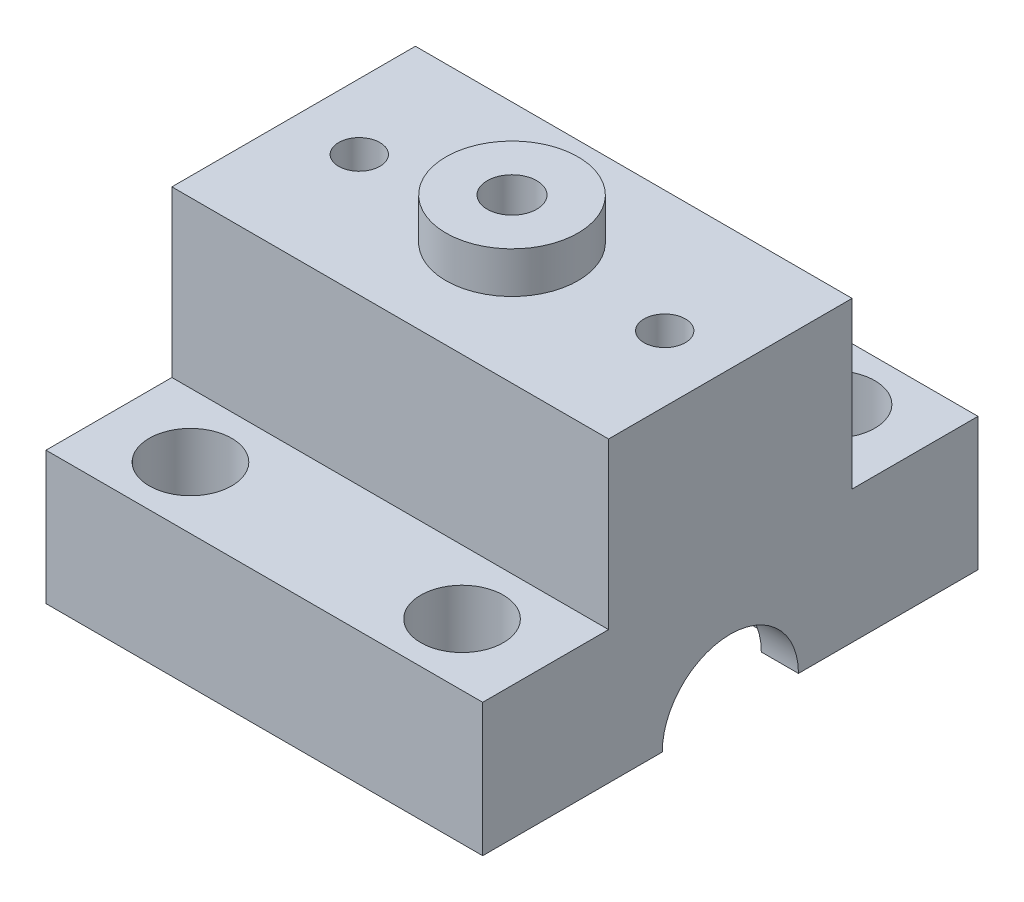
ISO-10303-21;
HEADER;
FILE_DESCRIPTION(('STEP AP214'),'2;1');
FILE_NAME('part.step','',(''),(''),'','','');
FILE_SCHEMA(('AUTOMOTIVE_DESIGN { 1 0 10303 214 1 1 1 1 }'));
ENDSEC;
DATA;
#1=APPLICATION_CONTEXT('core data for automotive mechanical design processes');
#2=APPLICATION_PROTOCOL_DEFINITION('international standard','automotive_design',2000,#1);
#3=PRODUCT_CONTEXT('',#1,'mechanical');
#4=PRODUCT('Part','Part','',(#3));
#5=PRODUCT_RELATED_PRODUCT_CATEGORY('part','',(#4));
#6=PRODUCT_DEFINITION_FORMATION('','',#4);
#7=PRODUCT_DEFINITION_CONTEXT('part definition',#1,'design');
#8=PRODUCT_DEFINITION('design','',#6,#7);
#9=PRODUCT_DEFINITION_SHAPE('','',#8);
#10=(LENGTH_UNIT() NAMED_UNIT(*) SI_UNIT(.MILLI.,.METRE.));
#11=(NAMED_UNIT(*) PLANE_ANGLE_UNIT() SI_UNIT($,.RADIAN.));
#12=(NAMED_UNIT(*) SI_UNIT($,.STERADIAN.) SOLID_ANGLE_UNIT());
#13=UNCERTAINTY_MEASURE_WITH_UNIT(LENGTH_MEASURE(1.E-05),#10,'distance_accuracy_value','');
#14=(GEOMETRIC_REPRESENTATION_CONTEXT(3) GLOBAL_UNCERTAINTY_ASSIGNED_CONTEXT((#13)) GLOBAL_UNIT_ASSIGNED_CONTEXT((#10,
#11,#12)) REPRESENTATION_CONTEXT('',''));
#15=CARTESIAN_POINT('',(0.,0.,0.));
#16=DIRECTION('',(0.,0.,1.));
#17=DIRECTION('',(1.,0.,0.));
#18=AXIS2_PLACEMENT_3D('',#15,#16,#17);
#19=CARTESIAN_POINT('',(0.,5.,0.));
#20=DIRECTION('',(0.,1.,0.));
#21=DIRECTION('',(0.,0.,1.));
#22=AXIS2_PLACEMENT_3D('',#19,#20,#21);
#23=PLANE('',#22);
#24=CARTESIAN_POINT('',(-16.45,5.,22.5));
#25=DIRECTION('',(0.,1.,0.));
#26=DIRECTION('',(0.,0.,1.));
#27=AXIS2_PLACEMENT_3D('',#24,#25,#26);
#28=CIRCLE('',#27,5.);
#29=CARTESIAN_POINT('',(-16.45,5.,27.5));
#30=VERTEX_POINT('',#29);
#31=EDGE_CURVE('E298',#30,#30,#28,.T.);
#32=ORIENTED_EDGE('',*,*,#31,.F.);
#33=EDGE_LOOP('',(#32));
#34=FACE_BOUND('',#33,.T.);
#35=CARTESIAN_POINT('',(16.45,5.,22.5));
#36=DIRECTION('',(0.,1.,0.));
#37=DIRECTION('',(0.,0.,1.));
#38=AXIS2_PLACEMENT_3D('',#35,#36,#37);
#39=CIRCLE('',#38,5.);
#40=CARTESIAN_POINT('',(16.45,5.,27.5));
#41=VERTEX_POINT('',#40);
#42=EDGE_CURVE('E299',#41,#41,#39,.T.);
#43=ORIENTED_EDGE('',*,*,#42,.F.);
#44=EDGE_LOOP('',(#43));
#45=FACE_BOUND('',#44,.T.);
#46=DIRECTION('',(0.,0.,-1.));
#47=VECTOR('',#46,1.);
#48=CARTESIAN_POINT('',(26.45,5.,-15.));
#49=LINE('',#48,#47);
#50=CARTESIAN_POINT('',(26.45,5.,30.));
#51=VERTEX_POINT('',#50);
#52=CARTESIAN_POINT('',(26.45,5.,14.75));
#53=VERTEX_POINT('',#52);
#54=EDGE_CURVE('E460',#51,#53,#49,.T.);
#55=ORIENTED_EDGE('',*,*,#54,.T.);
#56=DIRECTION('',(1.,0.,0.));
#57=VECTOR('',#56,1.);
#58=CARTESIAN_POINT('',(0.,5.,14.75));
#59=LINE('',#58,#57);
#60=CARTESIAN_POINT('',(-26.45,5.,14.75));
#61=VERTEX_POINT('',#60);
#62=EDGE_CURVE('E92',#61,#53,#59,.T.);
#63=ORIENTED_EDGE('',*,*,#62,.F.);
#64=DIRECTION('',(0.,0.,1.));
#65=VECTOR('',#64,1.);
#66=CARTESIAN_POINT('',(-26.45,5.,-15.));
#67=LINE('',#66,#65);
#68=CARTESIAN_POINT('',(-26.45,5.,30.));
#69=VERTEX_POINT('',#68);
#70=EDGE_CURVE('E463',#61,#69,#67,.T.);
#71=ORIENTED_EDGE('',*,*,#70,.T.);
#72=DIRECTION('',(1.,0.,0.));
#73=VECTOR('',#72,1.);
#74=CARTESIAN_POINT('',(26.45,5.,30.));
#75=LINE('',#74,#73);
#76=EDGE_CURVE('E322',#69,#51,#75,.T.);
#77=ORIENTED_EDGE('',*,*,#76,.T.);
#78=EDGE_LOOP('',(#55,#63,#71,#77));
#79=FACE_BOUND('',#78,.T.);
#80=ADVANCED_FACE('F68',(#34,#45,#79),#23,.T.);
#81=CARTESIAN_POINT('',(0.,25.,0.));
#82=DIRECTION('',(0.,1.,0.));
#83=DIRECTION('',(0.,0.,1.));
#84=AXIS2_PLACEMENT_3D('',#81,#82,#83);
#85=PLANE('',#84);
#86=CARTESIAN_POINT('',(0.,25.,0.));
#87=DIRECTION('',(0.,1.,0.));
#88=DIRECTION('',(0.,0.,1.));
#89=AXIS2_PLACEMENT_3D('',#86,#87,#88);
#90=CIRCLE('',#89,1.65);
#91=CARTESIAN_POINT('',(0.,25.,1.65));
#92=VERTEX_POINT('',#91);
#93=EDGE_CURVE('E346',#92,#92,#90,.T.);
#94=ORIENTED_EDGE('',*,*,#93,.F.);
#95=EDGE_LOOP('',(#94));
#96=FACE_BOUND('',#95,.T.);
#97=CARTESIAN_POINT('',(0.,25.,0.));
#98=DIRECTION('',(0.,1.,0.));
#99=DIRECTION('',(0.,0.,1.));
#100=AXIS2_PLACEMENT_3D('',#97,#98,#99);
#101=CIRCLE('',#100,3.);
#102=CARTESIAN_POINT('',(0.,25.,3.));
#103=VERTEX_POINT('',#102);
#104=EDGE_CURVE('E12',#103,#103,#101,.F.);
#105=ORIENTED_EDGE('',*,*,#104,.F.);
#106=EDGE_LOOP('',(#105));
#107=FACE_BOUND('',#106,.T.);
#108=ADVANCED_FACE('F551',(#96,#107),#85,.T.);
#109=DIRECTION('',(1.,0.,0.));
#110=VECTOR('',#109,1.);
#111=CARTESIAN_POINT('',(0.,5.,-14.75));
#112=LINE('',#111,#110);
#113=CARTESIAN_POINT('',(-26.45,5.,-14.75));
#114=VERTEX_POINT('',#113);
#115=CARTESIAN_POINT('',(26.45,5.,-14.75));
#116=VERTEX_POINT('',#115);
#117=EDGE_CURVE('E84',#114,#116,#112,.T.);
#118=ORIENTED_EDGE('',*,*,#117,.T.);
#119=CARTESIAN_POINT('',(26.45,5.,-30.));
#120=VERTEX_POINT('',#119);
#121=EDGE_CURVE('E459',#116,#120,#49,.T.);
#122=ORIENTED_EDGE('',*,*,#121,.T.);
#123=DIRECTION('',(-1.,0.,0.));
#124=VECTOR('',#123,1.);
#125=CARTESIAN_POINT('',(26.45,5.,-30.));
#126=LINE('',#125,#124);
#127=CARTESIAN_POINT('',(-26.45,5.,-30.));
#128=VERTEX_POINT('',#127);
#129=EDGE_CURVE('E329',#120,#128,#126,.T.);
#130=ORIENTED_EDGE('',*,*,#129,.T.);
#131=EDGE_CURVE('E464',#128,#114,#67,.T.);
#132=ORIENTED_EDGE('',*,*,#131,.T.);
#133=EDGE_LOOP('',(#118,#122,#130,#132));
#134=FACE_BOUND('',#133,.T.);
#135=CARTESIAN_POINT('',(-16.45,5.,-22.5));
#136=DIRECTION('',(0.,1.,0.));
#137=DIRECTION('',(0.,0.,1.));
#138=AXIS2_PLACEMENT_3D('',#135,#136,#137);
#139=CIRCLE('',#138,5.);
#140=CARTESIAN_POINT('',(-16.45,5.,-17.5));
#141=VERTEX_POINT('',#140);
#142=EDGE_CURVE('E290',#141,#141,#139,.T.);
#143=ORIENTED_EDGE('',*,*,#142,.F.);
#144=EDGE_LOOP('',(#143));
#145=FACE_BOUND('',#144,.T.);
#146=CARTESIAN_POINT('',(16.45,5.,-22.5));
#147=DIRECTION('',(0.,1.,0.));
#148=DIRECTION('',(0.,0.,1.));
#149=AXIS2_PLACEMENT_3D('',#146,#147,#148);
#150=CIRCLE('',#149,5.);
#151=CARTESIAN_POINT('',(16.45,5.,-17.5));
#152=VERTEX_POINT('',#151);
#153=EDGE_CURVE('E307',#152,#152,#150,.T.);
#154=ORIENTED_EDGE('',*,*,#153,.F.);
#155=EDGE_LOOP('',(#154));
#156=FACE_BOUND('',#155,.T.);
#157=ADVANCED_FACE('F557',(#134,#145,#156),#23,.T.);
#158=CARTESIAN_POINT('',(0.,-11.1,0.));
#159=DIRECTION('',(0.,-1.,0.));
#160=DIRECTION('',(0.,0.,-1.));
#161=AXIS2_PLACEMENT_3D('',#158,#159,#160);
#162=PLANE('',#161);
#163=CARTESIAN_POINT('',(16.45,-11.1,-22.5));
#164=DIRECTION('',(0.,1.,0.));
#165=DIRECTION('',(0.,0.,1.));
#166=AXIS2_PLACEMENT_3D('',#163,#164,#165);
#167=CIRCLE('',#166,2.2);
#168=CARTESIAN_POINT('',(16.45,-11.1,-20.3));
#169=VERTEX_POINT('',#168);
#170=EDGE_CURVE('E271',#169,#169,#167,.T.);
#171=ORIENTED_EDGE('',*,*,#170,.T.);
#172=EDGE_LOOP('',(#171));
#173=FACE_BOUND('',#172,.T.);
#174=CARTESIAN_POINT('',(-16.45,-11.1,-22.5));
#175=DIRECTION('',(0.,1.,0.));
#176=DIRECTION('',(0.,0.,1.));
#177=AXIS2_PLACEMENT_3D('',#174,#175,#176);
#178=CIRCLE('',#177,2.2);
#179=CARTESIAN_POINT('',(-16.45,-11.1,-20.3));
#180=VERTEX_POINT('',#179);
#181=EDGE_CURVE('E262',#180,#180,#178,.T.);
#182=ORIENTED_EDGE('',*,*,#181,.T.);
#183=EDGE_LOOP('',(#182));
#184=FACE_BOUND('',#183,.T.);
#185=DIRECTION('',(1.,0.,0.));
#186=VECTOR('',#185,1.);
#187=CARTESIAN_POINT('',(-26.45,-11.1,-8.25));
#188=LINE('',#187,#186);
#189=CARTESIAN_POINT('',(-26.45,-11.1,-8.25));
#190=VERTEX_POINT('',#189);
#191=CARTESIAN_POINT('',(-21.95,-11.1,-8.25));
#192=VERTEX_POINT('',#191);
#193=EDGE_CURVE('E396',#190,#192,#188,.T.);
#194=ORIENTED_EDGE('',*,*,#193,.F.);
#195=DIRECTION('',(0.,0.,-1.));
#196=VECTOR('',#195,1.);
#197=CARTESIAN_POINT('',(-26.45,-11.1,15.));
#198=LINE('',#197,#196);
#199=CARTESIAN_POINT('',(-26.45,-11.1,-30.));
#200=VERTEX_POINT('',#199);
#201=EDGE_CURVE('E445',#190,#200,#198,.T.);
#202=ORIENTED_EDGE('',*,*,#201,.T.);
#203=DIRECTION('',(-1.,0.,0.));
#204=VECTOR('',#203,1.);
#205=CARTESIAN_POINT('',(26.45,-11.1,-30.));
#206=LINE('',#205,#204);
#207=CARTESIAN_POINT('',(26.45,-11.1,-30.));
#208=VERTEX_POINT('',#207);
#209=EDGE_CURVE('E373',#208,#200,#206,.T.);
#210=ORIENTED_EDGE('',*,*,#209,.F.);
#211=DIRECTION('',(0.,0.,1.));
#212=VECTOR('',#211,1.);
#213=CARTESIAN_POINT('',(26.45,-11.1,15.));
#214=LINE('',#213,#212);
#215=CARTESIAN_POINT('',(26.45,-11.1,-8.25));
#216=VERTEX_POINT('',#215);
#217=EDGE_CURVE('E451',#208,#216,#214,.T.);
#218=ORIENTED_EDGE('',*,*,#217,.T.);
#219=CARTESIAN_POINT('',(21.95,-11.1,-8.25));
#220=VERTEX_POINT('',#219);
#221=EDGE_CURVE('E391',#220,#216,#188,.T.);
#222=ORIENTED_EDGE('',*,*,#221,.F.);
#223=DIRECTION('',(0.,0.,1.));
#224=VECTOR('',#223,1.);
#225=CARTESIAN_POINT('',(21.95,-11.1,10.5));
#226=LINE('',#225,#224);
#227=CARTESIAN_POINT('',(21.95,-11.1,-10.5));
#228=VERTEX_POINT('',#227);
#229=EDGE_CURVE('E413',#228,#220,#226,.T.);
#230=ORIENTED_EDGE('',*,*,#229,.F.);
#231=DIRECTION('',(1.,0.,0.));
#232=VECTOR('',#231,1.);
#233=CARTESIAN_POINT('',(-21.95,-11.1,-10.5));
#234=LINE('',#233,#232);
#235=CARTESIAN_POINT('',(-21.95,-11.1,-10.5));
#236=VERTEX_POINT('',#235);
#237=EDGE_CURVE('E408',#236,#228,#234,.T.);
#238=ORIENTED_EDGE('',*,*,#237,.F.);
#239=DIRECTION('',(0.,0.,-1.));
#240=VECTOR('',#239,1.);
#241=CARTESIAN_POINT('',(-21.95,-11.1,10.5));
#242=LINE('',#241,#240);
#243=EDGE_CURVE('E402',#192,#236,#242,.T.);
#244=ORIENTED_EDGE('',*,*,#243,.F.);
#245=EDGE_LOOP('',(#194,#202,#210,#218,#222,#230,#238,#244));
#246=FACE_BOUND('',#245,.T.);
#247=ADVANCED_FACE('F478',(#173,#184,#246),#162,.T.);
#248=CARTESIAN_POINT('',(0.,0.,0.));
#249=DIRECTION('',(0.,1.,0.));
#250=DIRECTION('',(0.,0.,1.));
#251=AXIS2_PLACEMENT_3D('',#248,#249,#250);
#252=PLANE('',#251);
#253=DIRECTION('',(0.,0.,1.));
#254=VECTOR('',#253,1.);
#255=CARTESIAN_POINT('',(21.95,0.,10.5));
#256=LINE('',#255,#254);
#257=CARTESIAN_POINT('',(21.95,0.,-10.5));
#258=VERTEX_POINT('',#257);
#259=CARTESIAN_POINT('',(21.95,0.,10.5));
#260=VERTEX_POINT('',#259);
#261=EDGE_CURVE('E403',#258,#260,#256,.T.);
#262=ORIENTED_EDGE('',*,*,#261,.T.);
#263=DIRECTION('',(-1.,0.,0.));
#264=VECTOR('',#263,1.);
#265=CARTESIAN_POINT('',(-21.95,0.,10.5));
#266=LINE('',#265,#264);
#267=CARTESIAN_POINT('',(-21.95,0.,10.5));
#268=VERTEX_POINT('',#267);
#269=EDGE_CURVE('E418',#260,#268,#266,.T.);
#270=ORIENTED_EDGE('',*,*,#269,.T.);
#271=DIRECTION('',(0.,0.,-1.));
#272=VECTOR('',#271,1.);
#273=CARTESIAN_POINT('',(-21.95,0.,10.5));
#274=LINE('',#273,#272);
#275=CARTESIAN_POINT('',(-21.95,0.,-10.5));
#276=VERTEX_POINT('',#275);
#277=EDGE_CURVE('E422',#268,#276,#274,.T.);
#278=ORIENTED_EDGE('',*,*,#277,.T.);
#279=DIRECTION('',(1.,0.,0.));
#280=VECTOR('',#279,1.);
#281=CARTESIAN_POINT('',(-21.95,0.,-10.5));
#282=LINE('',#281,#280);
#283=EDGE_CURVE('E426',#276,#258,#282,.T.);
#284=ORIENTED_EDGE('',*,*,#283,.T.);
#285=EDGE_LOOP('',(#262,#270,#278,#284));
#286=FACE_BOUND('',#285,.T.);
#287=CARTESIAN_POINT('',(0.,0.,0.));
#288=DIRECTION('',(0.,1.,0.));
#289=DIRECTION('',(0.,0.,1.));
#290=AXIS2_PLACEMENT_3D('',#287,#288,#289);
#291=CIRCLE('',#290,10.25);
#292=CARTESIAN_POINT('',(0.,0.,10.25));
#293=VERTEX_POINT('',#292);
#294=EDGE_CURVE('E455',#293,#293,#291,.T.);
#295=ORIENTED_EDGE('',*,*,#294,.T.);
#296=EDGE_LOOP('',(#295));
#297=FACE_BOUND('',#296,.T.);
#298=ADVANCED_FACE('F526',(#286,#297),#252,.F.);
#299=CARTESIAN_POINT('',(26.45,5.,-15.));
#300=DIRECTION('',(-1.,0.,0.));
#301=DIRECTION('',(0.,0.,1.));
#302=AXIS2_PLACEMENT_3D('',#299,#300,#301);
#303=PLANE('',#302);
#304=CARTESIAN_POINT('',(26.45,-11.1,8.25));
#305=VERTEX_POINT('',#304);
#306=CARTESIAN_POINT('',(26.45,-11.1,30.));
#307=VERTEX_POINT('',#306);
#308=EDGE_CURVE('E450',#305,#307,#214,.T.);
#309=ORIENTED_EDGE('',*,*,#308,.F.);
#310=CARTESIAN_POINT('',(26.45,-11.1,0.));
#311=DIRECTION('',(1.,0.,0.));
#312=DIRECTION('',(0.,0.,-1.));
#313=AXIS2_PLACEMENT_3D('',#310,#311,#312);
#314=CIRCLE('',#313,8.25);
#315=EDGE_CURVE('E381',#216,#305,#314,.T.);
#316=ORIENTED_EDGE('',*,*,#315,.F.);
#317=ORIENTED_EDGE('',*,*,#217,.F.);
#318=DIRECTION('',(0.,-1.,0.));
#319=VECTOR('',#318,1.);
#320=CARTESIAN_POINT('',(26.45,-11.1,-30.));
#321=LINE('',#320,#319);
#322=EDGE_CURVE('E369',#120,#208,#321,.T.);
#323=ORIENTED_EDGE('',*,*,#322,.F.);
#324=ORIENTED_EDGE('',*,*,#121,.F.);
#325=DIRECTION('',(0.,-1.,0.));
#326=VECTOR('',#325,1.);
#327=CARTESIAN_POINT('',(26.45,64.6213641865093,-14.75));
#328=LINE('',#327,#326);
#329=CARTESIAN_POINT('',(26.45,25.,-14.75));
#330=VERTEX_POINT('',#329);
#331=EDGE_CURVE('E218',#330,#116,#328,.T.);
#332=ORIENTED_EDGE('',*,*,#331,.F.);
#333=DIRECTION('',(0.,0.,-1.));
#334=VECTOR('',#333,1.);
#335=CARTESIAN_POINT('',(26.45,25.,0.));
#336=LINE('',#335,#334);
#337=CARTESIAN_POINT('',(26.45,25.,14.75));
#338=VERTEX_POINT('',#337);
#339=EDGE_CURVE('E237',#338,#330,#336,.T.);
#340=ORIENTED_EDGE('',*,*,#339,.F.);
#341=DIRECTION('',(0.,-1.,0.));
#342=VECTOR('',#341,1.);
#343=CARTESIAN_POINT('',(26.45,64.6213641865093,14.75));
#344=LINE('',#343,#342);
#345=EDGE_CURVE('E233',#338,#53,#344,.T.);
#346=ORIENTED_EDGE('',*,*,#345,.T.);
#347=ORIENTED_EDGE('',*,*,#54,.F.);
#348=DIRECTION('',(0.,1.,0.));
#349=VECTOR('',#348,1.);
#350=CARTESIAN_POINT('',(26.45,-11.1,30.));
#351=LINE('',#350,#349);
#352=EDGE_CURVE('E365',#307,#51,#351,.T.);
#353=ORIENTED_EDGE('',*,*,#352,.F.);
#354=EDGE_LOOP('',(#309,#316,#317,#323,#324,#332,#340,#346,#347,#353));
#355=FACE_BOUND('',#354,.T.);
#356=ADVANCED_FACE('F70',(#355),#303,.F.);
#357=CARTESIAN_POINT('',(-26.45,5.,-15.));
#358=DIRECTION('',(1.,0.,0.));
#359=DIRECTION('',(0.,0.,-1.));
#360=AXIS2_PLACEMENT_3D('',#357,#358,#359);
#361=PLANE('',#360);
#362=ORIENTED_EDGE('',*,*,#201,.F.);
#363=CARTESIAN_POINT('',(-26.45,-11.1,0.));
#364=DIRECTION('',(1.,0.,0.));
#365=DIRECTION('',(0.,0.,-1.));
#366=AXIS2_PLACEMENT_3D('',#363,#364,#365);
#367=CIRCLE('',#366,8.25);
#368=CARTESIAN_POINT('',(-26.45,-11.1,8.25));
#369=VERTEX_POINT('',#368);
#370=EDGE_CURVE('E382',#190,#369,#367,.T.);
#371=ORIENTED_EDGE('',*,*,#370,.T.);
#372=CARTESIAN_POINT('',(-26.45,-11.1,30.));
#373=VERTEX_POINT('',#372);
#374=EDGE_CURVE('E446',#373,#369,#198,.T.);
#375=ORIENTED_EDGE('',*,*,#374,.F.);
#376=DIRECTION('',(0.,-1.,0.));
#377=VECTOR('',#376,1.);
#378=CARTESIAN_POINT('',(-26.45,-11.1,30.));
#379=LINE('',#378,#377);
#380=EDGE_CURVE('E357',#69,#373,#379,.T.);
#381=ORIENTED_EDGE('',*,*,#380,.F.);
#382=ORIENTED_EDGE('',*,*,#70,.F.);
#383=DIRECTION('',(0.,-1.,0.));
#384=VECTOR('',#383,1.);
#385=CARTESIAN_POINT('',(-26.45,64.6213641865093,14.75));
#386=LINE('',#385,#384);
#387=CARTESIAN_POINT('',(-26.45,25.,14.75));
#388=VERTEX_POINT('',#387);
#389=EDGE_CURVE('E244',#388,#61,#386,.T.);
#390=ORIENTED_EDGE('',*,*,#389,.F.);
#391=DIRECTION('',(0.,0.,1.));
#392=VECTOR('',#391,1.);
#393=CARTESIAN_POINT('',(-26.45,25.,0.));
#394=LINE('',#393,#392);
#395=CARTESIAN_POINT('',(-26.45,25.,-14.75));
#396=VERTEX_POINT('',#395);
#397=EDGE_CURVE('E247',#396,#388,#394,.T.);
#398=ORIENTED_EDGE('',*,*,#397,.F.);
#399=DIRECTION('',(0.,-1.,0.));
#400=VECTOR('',#399,1.);
#401=CARTESIAN_POINT('',(-26.45,64.6213641865093,-14.75));
#402=LINE('',#401,#400);
#403=EDGE_CURVE('E257',#396,#114,#402,.T.);
#404=ORIENTED_EDGE('',*,*,#403,.T.);
#405=ORIENTED_EDGE('',*,*,#131,.F.);
#406=DIRECTION('',(0.,1.,0.));
#407=VECTOR('',#406,1.);
#408=CARTESIAN_POINT('',(-26.45,-11.1,-30.));
#409=LINE('',#408,#407);
#410=EDGE_CURVE('E377',#200,#128,#409,.T.);
#411=ORIENTED_EDGE('',*,*,#410,.F.);
#412=EDGE_LOOP('',(#362,#371,#375,#381,#382,#390,#398,#404,#405,#411));
#413=FACE_BOUND('',#412,.T.);
#414=ADVANCED_FACE('F500',(#413),#361,.F.);
#415=CARTESIAN_POINT('',(0.,5.,0.));
#416=DIRECTION('',(0.,-1.,0.));
#417=DIRECTION('',(0.,0.,-1.));
#418=AXIS2_PLACEMENT_3D('',#415,#416,#417);
#419=CYLINDRICAL_SURFACE('',#418,10.25);
#420=ORIENTED_EDGE('',*,*,#294,.F.);
#421=EDGE_LOOP('',(#420));
#422=FACE_BOUND('',#421,.T.);
#423=CARTESIAN_POINT('',(0.,20.,0.));
#424=DIRECTION('',(0.,1.,0.));
#425=DIRECTION('',(0.,0.,1.));
#426=AXIS2_PLACEMENT_3D('',#423,#424,#425);
#427=CIRCLE('',#426,10.25);
#428=CARTESIAN_POINT('',(0.,20.,10.25));
#429=VERTEX_POINT('',#428);
#430=EDGE_CURVE('E350',#429,#429,#427,.T.);
#431=ORIENTED_EDGE('',*,*,#430,.T.);
#432=EDGE_LOOP('',(#431));
#433=FACE_BOUND('',#432,.T.);
#434=ADVANCED_FACE('F532',(#422,#433),#419,.F.);
#435=CARTESIAN_POINT('',(16.45,-11.1,22.5));
#436=DIRECTION('',(0.,1.,0.));
#437=DIRECTION('',(0.,0.,1.));
#438=AXIS2_PLACEMENT_3D('',#435,#436,#437);
#439=CIRCLE('',#438,2.2);
#440=CARTESIAN_POINT('',(16.45,-11.1,24.7));
#441=VERTEX_POINT('',#440);
#442=EDGE_CURVE('E279',#441,#441,#439,.T.);
#443=ORIENTED_EDGE('',*,*,#442,.T.);
#444=EDGE_LOOP('',(#443));
#445=FACE_BOUND('',#444,.T.);
#446=CARTESIAN_POINT('',(-16.45,-11.1,22.5));
#447=DIRECTION('',(0.,1.,0.));
#448=DIRECTION('',(0.,0.,1.));
#449=AXIS2_PLACEMENT_3D('',#446,#447,#448);
#450=CIRCLE('',#449,2.2);
#451=CARTESIAN_POINT('',(-16.45,-11.1,24.7));
#452=VERTEX_POINT('',#451);
#453=EDGE_CURVE('E286',#452,#452,#450,.T.);
#454=ORIENTED_EDGE('',*,*,#453,.T.);
#455=EDGE_LOOP('',(#454));
#456=FACE_BOUND('',#455,.T.);
#457=DIRECTION('',(1.,0.,0.));
#458=VECTOR('',#457,1.);
#459=CARTESIAN_POINT('',(-26.45,-11.1,8.25));
#460=LINE('',#459,#458);
#461=CARTESIAN_POINT('',(21.95,-11.1,8.25));
#462=VERTEX_POINT('',#461);
#463=EDGE_CURVE('E386',#305,#462,#460,.F.);
#464=ORIENTED_EDGE('',*,*,#463,.F.);
#465=ORIENTED_EDGE('',*,*,#308,.T.);
#466=DIRECTION('',(1.,0.,0.));
#467=VECTOR('',#466,1.);
#468=CARTESIAN_POINT('',(-26.45,-11.1,30.));
#469=LINE('',#468,#467);
#470=EDGE_CURVE('E361',#373,#307,#469,.T.);
#471=ORIENTED_EDGE('',*,*,#470,.F.);
#472=ORIENTED_EDGE('',*,*,#374,.T.);
#473=CARTESIAN_POINT('',(-21.95,-11.1,8.25));
#474=VERTEX_POINT('',#473);
#475=EDGE_CURVE('E392',#474,#369,#460,.F.);
#476=ORIENTED_EDGE('',*,*,#475,.F.);
#477=CARTESIAN_POINT('',(-21.95,-11.1,10.5));
#478=VERTEX_POINT('',#477);
#479=EDGE_CURVE('E404',#478,#474,#242,.T.);
#480=ORIENTED_EDGE('',*,*,#479,.F.);
#481=DIRECTION('',(-1.,0.,0.));
#482=VECTOR('',#481,1.);
#483=CARTESIAN_POINT('',(-21.95,-11.1,10.5));
#484=LINE('',#483,#482);
#485=CARTESIAN_POINT('',(21.95,-11.1,10.5));
#486=VERTEX_POINT('',#485);
#487=EDGE_CURVE('E399',#486,#478,#484,.T.);
#488=ORIENTED_EDGE('',*,*,#487,.F.);
#489=EDGE_CURVE('E412',#462,#486,#226,.T.);
#490=ORIENTED_EDGE('',*,*,#489,.F.);
#491=EDGE_LOOP('',(#464,#465,#471,#472,#476,#480,#488,#490));
#492=FACE_BOUND('',#491,.T.);
#493=ADVANCED_FACE('F504',(#445,#456,#492),#162,.T.);
#494=CARTESIAN_POINT('',(-21.95,-11.1,10.5));
#495=DIRECTION('',(0.,0.,-1.));
#496=DIRECTION('',(-1.,0.,0.));
#497=AXIS2_PLACEMENT_3D('',#494,#495,#496);
#498=PLANE('',#497);
#499=ORIENTED_EDGE('',*,*,#269,.F.);
#500=DIRECTION('',(0.,1.,0.));
#501=VECTOR('',#500,1.);
#502=CARTESIAN_POINT('',(21.95,-11.1,10.5));
#503=LINE('',#502,#501);
#504=EDGE_CURVE('E417',#486,#260,#503,.T.);
#505=ORIENTED_EDGE('',*,*,#504,.F.);
#506=ORIENTED_EDGE('',*,*,#487,.T.);
#507=DIRECTION('',(0.,1.,0.));
#508=VECTOR('',#507,1.);
#509=CARTESIAN_POINT('',(-21.95,-11.1,10.5));
#510=LINE('',#509,#508);
#511=EDGE_CURVE('E441',#478,#268,#510,.T.);
#512=ORIENTED_EDGE('',*,*,#511,.T.);
#513=EDGE_LOOP('',(#499,#505,#506,#512));
#514=FACE_BOUND('',#513,.T.);
#515=ADVANCED_FACE('F522',(#514),#498,.T.);
#516=CARTESIAN_POINT('',(-21.95,-11.1,10.5));
#517=DIRECTION('',(1.,0.,0.));
#518=DIRECTION('',(0.,0.,-1.));
#519=AXIS2_PLACEMENT_3D('',#516,#517,#518);
#520=PLANE('',#519);
#521=CARTESIAN_POINT('',(-21.95,-11.1,0.));
#522=DIRECTION('',(1.,0.,0.));
#523=DIRECTION('',(0.,0.,-1.));
#524=AXIS2_PLACEMENT_3D('',#521,#522,#523);
#525=CIRCLE('',#524,8.25);
#526=EDGE_CURVE('E395',#192,#474,#525,.T.);
#527=ORIENTED_EDGE('',*,*,#526,.F.);
#528=ORIENTED_EDGE('',*,*,#243,.T.);
#529=DIRECTION('',(0.,1.,0.));
#530=VECTOR('',#529,1.);
#531=CARTESIAN_POINT('',(-21.95,-11.1,-10.5));
#532=LINE('',#531,#530);
#533=EDGE_CURVE('E438',#236,#276,#532,.T.);
#534=ORIENTED_EDGE('',*,*,#533,.T.);
#535=ORIENTED_EDGE('',*,*,#277,.F.);
#536=ORIENTED_EDGE('',*,*,#511,.F.);
#537=ORIENTED_EDGE('',*,*,#479,.T.);
#538=EDGE_LOOP('',(#527,#528,#534,#535,#536,#537));
#539=FACE_BOUND('',#538,.T.);
#540=ADVANCED_FACE('F524',(#539),#520,.T.);
#541=CARTESIAN_POINT('',(-21.95,-11.1,-10.5));
#542=DIRECTION('',(0.,0.,1.));
#543=DIRECTION('',(1.,0.,0.));
#544=AXIS2_PLACEMENT_3D('',#541,#542,#543);
#545=PLANE('',#544);
#546=ORIENTED_EDGE('',*,*,#283,.F.);
#547=ORIENTED_EDGE('',*,*,#533,.F.);
#548=ORIENTED_EDGE('',*,*,#237,.T.);
#549=DIRECTION('',(0.,1.,0.));
#550=VECTOR('',#549,1.);
#551=CARTESIAN_POINT('',(21.95,-11.1,-10.5));
#552=LINE('',#551,#550);
#553=EDGE_CURVE('E435',#228,#258,#552,.T.);
#554=ORIENTED_EDGE('',*,*,#553,.T.);
#555=EDGE_LOOP('',(#546,#547,#548,#554));
#556=FACE_BOUND('',#555,.T.);
#557=ADVANCED_FACE('F486',(#556),#545,.T.);
#558=CARTESIAN_POINT('',(21.95,-11.1,10.5));
#559=DIRECTION('',(-1.,0.,0.));
#560=DIRECTION('',(0.,0.,1.));
#561=AXIS2_PLACEMENT_3D('',#558,#559,#560);
#562=PLANE('',#561);
#563=CARTESIAN_POINT('',(21.95,-11.1,0.));
#564=DIRECTION('',(-1.,0.,0.));
#565=DIRECTION('',(0.,0.,1.));
#566=AXIS2_PLACEMENT_3D('',#563,#564,#565);
#567=CIRCLE('',#566,8.25);
#568=EDGE_CURVE('E77',#462,#220,#567,.T.);
#569=ORIENTED_EDGE('',*,*,#568,.F.);
#570=ORIENTED_EDGE('',*,*,#489,.T.);
#571=ORIENTED_EDGE('',*,*,#504,.T.);
#572=ORIENTED_EDGE('',*,*,#261,.F.);
#573=ORIENTED_EDGE('',*,*,#553,.F.);
#574=ORIENTED_EDGE('',*,*,#229,.T.);
#575=EDGE_LOOP('',(#569,#570,#571,#572,#573,#574));
#576=FACE_BOUND('',#575,.T.);
#577=ADVANCED_FACE('F481',(#576),#562,.T.);
#578=CARTESIAN_POINT('',(-26.45,-11.1,0.));
#579=DIRECTION('',(1.,0.,0.));
#580=DIRECTION('',(0.,0.,-1.));
#581=AXIS2_PLACEMENT_3D('',#578,#579,#580);
#582=CYLINDRICAL_SURFACE('',#581,8.25);
#583=ORIENTED_EDGE('',*,*,#221,.T.);
#584=ORIENTED_EDGE('',*,*,#315,.T.);
#585=ORIENTED_EDGE('',*,*,#463,.T.);
#586=ORIENTED_EDGE('',*,*,#568,.T.);
#587=EDGE_LOOP('',(#583,#584,#585,#586));
#588=FACE_BOUND('',#587,.T.);
#589=ADVANCED_FACE('F470',(#588),#582,.F.);
#590=ORIENTED_EDGE('',*,*,#193,.T.);
#591=ORIENTED_EDGE('',*,*,#526,.T.);
#592=ORIENTED_EDGE('',*,*,#475,.T.);
#593=ORIENTED_EDGE('',*,*,#370,.F.);
#594=EDGE_LOOP('',(#590,#591,#592,#593));
#595=FACE_BOUND('',#594,.T.);
#596=ADVANCED_FACE('F496',(#595),#582,.F.);
#597=CARTESIAN_POINT('',(0.,0.,-30.));
#598=DIRECTION('',(0.,0.,1.));
#599=DIRECTION('',(1.,0.,0.));
#600=AXIS2_PLACEMENT_3D('',#597,#598,#599);
#601=PLANE('',#600);
#602=ORIENTED_EDGE('',*,*,#322,.T.);
#603=ORIENTED_EDGE('',*,*,#209,.T.);
#604=ORIENTED_EDGE('',*,*,#410,.T.);
#605=ORIENTED_EDGE('',*,*,#129,.F.);
#606=EDGE_LOOP('',(#602,#603,#604,#605));
#607=FACE_BOUND('',#606,.T.);
#608=ADVANCED_FACE('F552',(#607),#601,.F.);
#609=CARTESIAN_POINT('',(0.,0.,30.));
#610=DIRECTION('',(0.,0.,-1.));
#611=DIRECTION('',(-1.,0.,0.));
#612=AXIS2_PLACEMENT_3D('',#609,#610,#611);
#613=PLANE('',#612);
#614=ORIENTED_EDGE('',*,*,#380,.T.);
#615=ORIENTED_EDGE('',*,*,#470,.T.);
#616=ORIENTED_EDGE('',*,*,#352,.T.);
#617=ORIENTED_EDGE('',*,*,#76,.F.);
#618=EDGE_LOOP('',(#614,#615,#616,#617));
#619=FACE_BOUND('',#618,.T.);
#620=ADVANCED_FACE('F509',(#619),#613,.F.);
#621=CARTESIAN_POINT('',(0.,20.,0.));
#622=DIRECTION('',(0.,1.,0.));
#623=DIRECTION('',(0.,0.,1.));
#624=AXIS2_PLACEMENT_3D('',#621,#622,#623);
#625=PLANE('',#624);
#626=CARTESIAN_POINT('',(0.,20.,0.));
#627=DIRECTION('',(0.,1.,0.));
#628=DIRECTION('',(0.,0.,1.));
#629=AXIS2_PLACEMENT_3D('',#626,#627,#628);
#630=CIRCLE('',#629,1.65);
#631=CARTESIAN_POINT('',(0.,20.,1.65));
#632=VERTEX_POINT('',#631);
#633=EDGE_CURVE('E342',#632,#632,#630,.T.);
#634=ORIENTED_EDGE('',*,*,#633,.T.);
#635=EDGE_LOOP('',(#634));
#636=FACE_BOUND('',#635,.T.);
#637=ORIENTED_EDGE('',*,*,#430,.F.);
#638=EDGE_LOOP('',(#637));
#639=FACE_BOUND('',#638,.T.);
#640=ADVANCED_FACE('F538',(#636,#639),#625,.F.);
#641=CARTESIAN_POINT('',(18.5,25.,0.));
#642=DIRECTION('',(0.,1.,0.));
#643=DIRECTION('',(0.,0.,1.));
#644=AXIS2_PLACEMENT_3D('',#641,#642,#643);
#645=CIRCLE('',#644,2.5);
#646=CARTESIAN_POINT('',(18.5,25.,2.50000000000001));
#647=VERTEX_POINT('',#646);
#648=EDGE_CURVE('E219',#647,#647,#645,.T.);
#649=ORIENTED_EDGE('',*,*,#648,.F.);
#650=EDGE_LOOP('',(#649));
#651=FACE_BOUND('',#650,.T.);
#652=CARTESIAN_POINT('',(-18.5,25.,0.));
#653=DIRECTION('',(0.,1.,0.));
#654=DIRECTION('',(0.,0.,1.));
#655=AXIS2_PLACEMENT_3D('',#652,#653,#654);
#656=CIRCLE('',#655,2.5);
#657=CARTESIAN_POINT('',(-18.5,25.,2.5));
#658=VERTEX_POINT('',#657);
#659=EDGE_CURVE('E213',#658,#658,#656,.T.);
#660=ORIENTED_EDGE('',*,*,#659,.F.);
#661=EDGE_LOOP('',(#660));
#662=FACE_BOUND('',#661,.T.);
#663=CARTESIAN_POINT('',(0.,25.,0.));
#664=DIRECTION('',(0.,1.,0.));
#665=DIRECTION('',(0.,0.,1.));
#666=AXIS2_PLACEMENT_3D('',#663,#664,#665);
#667=CIRCLE('',#666,8.);
#668=CARTESIAN_POINT('',(0.,25.,8.));
#669=VERTEX_POINT('',#668);
#670=EDGE_CURVE('E337',#669,#669,#667,.T.);
#671=ORIENTED_EDGE('',*,*,#670,.F.);
#672=EDGE_LOOP('',(#671));
#673=FACE_BOUND('',#672,.T.);
#674=DIRECTION('',(1.,0.,0.));
#675=VECTOR('',#674,1.);
#676=CARTESIAN_POINT('',(0.,25.,14.75));
#677=LINE('',#676,#675);
#678=EDGE_CURVE('E248',#388,#338,#677,.T.);
#679=ORIENTED_EDGE('',*,*,#678,.T.);
#680=ORIENTED_EDGE('',*,*,#339,.T.);
#681=DIRECTION('',(1.,0.,0.));
#682=VECTOR('',#681,1.);
#683=CARTESIAN_POINT('',(0.,25.,-14.75));
#684=LINE('',#683,#682);
#685=EDGE_CURVE('E241',#396,#330,#684,.T.);
#686=ORIENTED_EDGE('',*,*,#685,.F.);
#687=ORIENTED_EDGE('',*,*,#397,.T.);
#688=EDGE_LOOP('',(#679,#680,#686,#687));
#689=FACE_BOUND('',#688,.T.);
#690=ADVANCED_FACE('F540',(#651,#662,#673,#689),#85,.T.);
#691=CARTESIAN_POINT('',(0.,25.,0.));
#692=DIRECTION('',(0.,-1.,0.));
#693=DIRECTION('',(0.,0.,-1.));
#694=AXIS2_PLACEMENT_3D('',#691,#692,#693);
#695=CYLINDRICAL_SURFACE('',#694,1.65);
#696=ORIENTED_EDGE('',*,*,#93,.T.);
#697=EDGE_LOOP('',(#696));
#698=FACE_BOUND('',#697,.T.);
#699=ORIENTED_EDGE('',*,*,#633,.F.);
#700=EDGE_LOOP('',(#699));
#701=FACE_BOUND('',#700,.T.);
#702=ADVANCED_FACE('F548',(#698,#701),#695,.F.);
#703=CARTESIAN_POINT('',(0.,30.,0.));
#704=DIRECTION('',(0.,1.,0.));
#705=DIRECTION('',(0.,0.,1.));
#706=AXIS2_PLACEMENT_3D('',#703,#704,#705);
#707=PLANE('',#706);
#708=CARTESIAN_POINT('',(0.,30.,0.));
#709=DIRECTION('',(0.,1.,0.));
#710=DIRECTION('',(0.,0.,1.));
#711=AXIS2_PLACEMENT_3D('',#708,#709,#710);
#712=CIRCLE('',#711,8.);
#713=CARTESIAN_POINT('',(0.,30.,8.));
#714=VERTEX_POINT('',#713);
#715=EDGE_CURVE('E338',#714,#714,#712,.T.);
#716=ORIENTED_EDGE('',*,*,#715,.T.);
#717=EDGE_LOOP('',(#716));
#718=FACE_BOUND('',#717,.T.);
#719=CARTESIAN_POINT('',(0.,30.,0.));
#720=DIRECTION('',(0.,1.,0.));
#721=DIRECTION('',(0.,0.,1.));
#722=AXIS2_PLACEMENT_3D('',#719,#720,#721);
#723=CIRCLE('',#722,3.);
#724=CARTESIAN_POINT('',(0.,30.,3.));
#725=VERTEX_POINT('',#724);
#726=EDGE_CURVE('E333',#725,#725,#723,.T.);
#727=ORIENTED_EDGE('',*,*,#726,.F.);
#728=EDGE_LOOP('',(#727));
#729=FACE_BOUND('',#728,.T.);
#730=ADVANCED_FACE('F615',(#718,#729),#707,.T.);
#731=CARTESIAN_POINT('',(0.,30.,0.));
#732=DIRECTION('',(0.,-1.,0.));
#733=DIRECTION('',(0.,0.,-1.));
#734=AXIS2_PLACEMENT_3D('',#731,#732,#733);
#735=CYLINDRICAL_SURFACE('',#734,8.);
#736=ORIENTED_EDGE('',*,*,#715,.F.);
#737=EDGE_LOOP('',(#736));
#738=FACE_BOUND('',#737,.T.);
#739=ORIENTED_EDGE('',*,*,#670,.T.);
#740=EDGE_LOOP('',(#739));
#741=FACE_BOUND('',#740,.T.);
#742=ADVANCED_FACE('F613',(#738,#741),#735,.T.);
#743=CARTESIAN_POINT('',(0.,30.,0.));
#744=DIRECTION('',(0.,-1.,0.));
#745=DIRECTION('',(0.,0.,-1.));
#746=AXIS2_PLACEMENT_3D('',#743,#744,#745);
#747=CYLINDRICAL_SURFACE('',#746,3.);
#748=ORIENTED_EDGE('',*,*,#726,.T.);
#749=EDGE_LOOP('',(#748));
#750=FACE_BOUND('',#749,.T.);
#751=ORIENTED_EDGE('',*,*,#104,.T.);
#752=EDGE_LOOP('',(#751));
#753=FACE_BOUND('',#752,.T.);
#754=ADVANCED_FACE('F609',(#750,#753),#747,.F.);
#755=CARTESIAN_POINT('',(-16.45,-3.,22.5));
#756=DIRECTION('',(0.,1.,0.));
#757=DIRECTION('',(0.,0.,1.));
#758=AXIS2_PLACEMENT_3D('',#755,#756,#757);
#759=CYLINDRICAL_SURFACE('',#758,5.);
#760=CARTESIAN_POINT('',(-16.45,-3.,22.5));
#761=DIRECTION('',(0.,1.,0.));
#762=DIRECTION('',(0.,0.,1.));
#763=AXIS2_PLACEMENT_3D('',#760,#761,#762);
#764=CIRCLE('',#763,5.);
#765=CARTESIAN_POINT('',(-16.45,-3.,27.5));
#766=VERTEX_POINT('',#765);
#767=EDGE_CURVE('E318',#766,#766,#764,.T.);
#768=ORIENTED_EDGE('',*,*,#767,.F.);
#769=EDGE_LOOP('',(#768));
#770=FACE_BOUND('',#769,.T.);
#771=ORIENTED_EDGE('',*,*,#31,.T.);
#772=EDGE_LOOP('',(#771));
#773=FACE_BOUND('',#772,.T.);
#774=ADVANCED_FACE('F605',(#770,#773),#759,.F.);
#775=CARTESIAN_POINT('',(-16.45,-3.,22.5));
#776=DIRECTION('',(0.,1.,0.));
#777=DIRECTION('',(0.,0.,1.));
#778=AXIS2_PLACEMENT_3D('',#775,#776,#777);
#779=PLANE('',#778);
#780=CARTESIAN_POINT('',(-16.45,-3.,22.5));
#781=DIRECTION('',(0.,1.,0.));
#782=DIRECTION('',(0.,0.,1.));
#783=AXIS2_PLACEMENT_3D('',#780,#781,#782);
#784=CIRCLE('',#783,2.2);
#785=CARTESIAN_POINT('',(-16.45,-3.,24.7));
#786=VERTEX_POINT('',#785);
#787=EDGE_CURVE('E266',#786,#786,#784,.T.);
#788=ORIENTED_EDGE('',*,*,#787,.F.);
#789=EDGE_LOOP('',(#788));
#790=FACE_BOUND('',#789,.T.);
#791=ORIENTED_EDGE('',*,*,#767,.T.);
#792=EDGE_LOOP('',(#791));
#793=FACE_BOUND('',#792,.T.);
#794=ADVANCED_FACE('F602',(#790,#793),#779,.T.);
#795=CARTESIAN_POINT('',(16.45,-3.,22.5));
#796=DIRECTION('',(0.,1.,0.));
#797=DIRECTION('',(0.,0.,1.));
#798=AXIS2_PLACEMENT_3D('',#795,#796,#797);
#799=CYLINDRICAL_SURFACE('',#798,5.);
#800=CARTESIAN_POINT('',(16.45,-3.,22.5));
#801=DIRECTION('',(0.,1.,0.));
#802=DIRECTION('',(0.,0.,1.));
#803=AXIS2_PLACEMENT_3D('',#800,#801,#802);
#804=CIRCLE('',#803,5.);
#805=CARTESIAN_POINT('',(16.45,-3.,27.5));
#806=VERTEX_POINT('',#805);
#807=EDGE_CURVE('E294',#806,#806,#804,.T.);
#808=ORIENTED_EDGE('',*,*,#807,.F.);
#809=EDGE_LOOP('',(#808));
#810=FACE_BOUND('',#809,.T.);
#811=ORIENTED_EDGE('',*,*,#42,.T.);
#812=EDGE_LOOP('',(#811));
#813=FACE_BOUND('',#812,.T.);
#814=ADVANCED_FACE('F588',(#810,#813),#799,.F.);
#815=CARTESIAN_POINT('',(16.45,-3.,22.5));
#816=DIRECTION('',(0.,1.,0.));
#817=DIRECTION('',(0.,0.,1.));
#818=AXIS2_PLACEMENT_3D('',#815,#816,#817);
#819=PLANE('',#818);
#820=CARTESIAN_POINT('',(16.45,-3.,22.5));
#821=DIRECTION('',(0.,1.,0.));
#822=DIRECTION('',(0.,0.,1.));
#823=AXIS2_PLACEMENT_3D('',#820,#821,#822);
#824=CIRCLE('',#823,2.2);
#825=CARTESIAN_POINT('',(16.45,-3.,24.7));
#826=VERTEX_POINT('',#825);
#827=EDGE_CURVE('E251',#826,#826,#824,.T.);
#828=ORIENTED_EDGE('',*,*,#827,.F.);
#829=EDGE_LOOP('',(#828));
#830=FACE_BOUND('',#829,.T.);
#831=ORIENTED_EDGE('',*,*,#807,.T.);
#832=EDGE_LOOP('',(#831));
#833=FACE_BOUND('',#832,.T.);
#834=ADVANCED_FACE('F578',(#830,#833),#819,.T.);
#835=CARTESIAN_POINT('',(16.45,-3.,-22.5));
#836=DIRECTION('',(0.,1.,0.));
#837=DIRECTION('',(0.,0.,1.));
#838=AXIS2_PLACEMENT_3D('',#835,#836,#837);
#839=CYLINDRICAL_SURFACE('',#838,5.);
#840=CARTESIAN_POINT('',(16.45,-3.,-22.5));
#841=DIRECTION('',(0.,1.,0.));
#842=DIRECTION('',(0.,0.,1.));
#843=AXIS2_PLACEMENT_3D('',#840,#841,#842);
#844=CIRCLE('',#843,5.);
#845=CARTESIAN_POINT('',(16.45,-3.,-17.5));
#846=VERTEX_POINT('',#845);
#847=EDGE_CURVE('E303',#846,#846,#844,.T.);
#848=ORIENTED_EDGE('',*,*,#847,.F.);
#849=EDGE_LOOP('',(#848));
#850=FACE_BOUND('',#849,.T.);
#851=ORIENTED_EDGE('',*,*,#153,.T.);
#852=EDGE_LOOP('',(#851));
#853=FACE_BOUND('',#852,.T.);
#854=ADVANCED_FACE('F575',(#850,#853),#839,.F.);
#855=CARTESIAN_POINT('',(16.45,-3.,-22.5));
#856=DIRECTION('',(0.,1.,0.));
#857=DIRECTION('',(0.,0.,1.));
#858=AXIS2_PLACEMENT_3D('',#855,#856,#857);
#859=PLANE('',#858);
#860=CARTESIAN_POINT('',(16.45,-3.,-22.5));
#861=DIRECTION('',(0.,1.,0.));
#862=DIRECTION('',(0.,0.,1.));
#863=AXIS2_PLACEMENT_3D('',#860,#861,#862);
#864=CIRCLE('',#863,2.2);
#865=CARTESIAN_POINT('',(16.45,-3.,-20.3));
#866=VERTEX_POINT('',#865);
#867=EDGE_CURVE('E275',#866,#866,#864,.T.);
#868=ORIENTED_EDGE('',*,*,#867,.F.);
#869=EDGE_LOOP('',(#868));
#870=FACE_BOUND('',#869,.T.);
#871=ORIENTED_EDGE('',*,*,#847,.T.);
#872=EDGE_LOOP('',(#871));
#873=FACE_BOUND('',#872,.T.);
#874=ADVANCED_FACE('F577',(#870,#873),#859,.T.);
#875=CARTESIAN_POINT('',(-16.45,-3.,-22.5));
#876=DIRECTION('',(0.,1.,0.));
#877=DIRECTION('',(0.,0.,1.));
#878=AXIS2_PLACEMENT_3D('',#875,#876,#877);
#879=CYLINDRICAL_SURFACE('',#878,5.);
#880=CARTESIAN_POINT('',(-16.45,-3.,-22.5));
#881=DIRECTION('',(0.,1.,0.));
#882=DIRECTION('',(0.,0.,1.));
#883=AXIS2_PLACEMENT_3D('',#880,#881,#882);
#884=CIRCLE('',#883,5.);
#885=CARTESIAN_POINT('',(-16.45,-3.,-17.5));
#886=VERTEX_POINT('',#885);
#887=EDGE_CURVE('E311',#886,#886,#884,.T.);
#888=ORIENTED_EDGE('',*,*,#887,.F.);
#889=EDGE_LOOP('',(#888));
#890=FACE_BOUND('',#889,.T.);
#891=ORIENTED_EDGE('',*,*,#142,.T.);
#892=EDGE_LOOP('',(#891));
#893=FACE_BOUND('',#892,.T.);
#894=ADVANCED_FACE('F585',(#890,#893),#879,.F.);
#895=CARTESIAN_POINT('',(-16.45,-3.,-22.5));
#896=DIRECTION('',(0.,1.,0.));
#897=DIRECTION('',(0.,0.,1.));
#898=AXIS2_PLACEMENT_3D('',#895,#896,#897);
#899=PLANE('',#898);
#900=CARTESIAN_POINT('',(-16.45,-3.,-22.5));
#901=DIRECTION('',(0.,1.,0.));
#902=DIRECTION('',(0.,0.,1.));
#903=AXIS2_PLACEMENT_3D('',#900,#901,#902);
#904=CIRCLE('',#903,2.2);
#905=CARTESIAN_POINT('',(-16.45,-3.,-20.3));
#906=VERTEX_POINT('',#905);
#907=EDGE_CURVE('E267',#906,#906,#904,.T.);
#908=ORIENTED_EDGE('',*,*,#907,.F.);
#909=EDGE_LOOP('',(#908));
#910=FACE_BOUND('',#909,.T.);
#911=ORIENTED_EDGE('',*,*,#887,.T.);
#912=EDGE_LOOP('',(#911));
#913=FACE_BOUND('',#912,.T.);
#914=ADVANCED_FACE('F594',(#910,#913),#899,.T.);
#915=CARTESIAN_POINT('',(-16.45,-11.1,22.5));
#916=DIRECTION('',(0.,1.,0.));
#917=DIRECTION('',(0.,0.,1.));
#918=AXIS2_PLACEMENT_3D('',#915,#916,#917);
#919=CYLINDRICAL_SURFACE('',#918,2.2);
#920=ORIENTED_EDGE('',*,*,#453,.F.);
#921=EDGE_LOOP('',(#920));
#922=FACE_BOUND('',#921,.T.);
#923=ORIENTED_EDGE('',*,*,#787,.T.);
#924=EDGE_LOOP('',(#923));
#925=FACE_BOUND('',#924,.T.);
#926=ADVANCED_FACE('F597',(#922,#925),#919,.F.);
#927=CARTESIAN_POINT('',(16.45,-11.1,22.5));
#928=DIRECTION('',(0.,1.,0.));
#929=DIRECTION('',(0.,0.,1.));
#930=AXIS2_PLACEMENT_3D('',#927,#928,#929);
#931=CYLINDRICAL_SURFACE('',#930,2.2);
#932=ORIENTED_EDGE('',*,*,#442,.F.);
#933=EDGE_LOOP('',(#932));
#934=FACE_BOUND('',#933,.T.);
#935=ORIENTED_EDGE('',*,*,#827,.T.);
#936=EDGE_LOOP('',(#935));
#937=FACE_BOUND('',#936,.T.);
#938=ADVANCED_FACE('F691',(#934,#937),#931,.F.);
#939=CARTESIAN_POINT('',(-16.45,-11.1,-22.5));
#940=DIRECTION('',(0.,1.,0.));
#941=DIRECTION('',(0.,0.,1.));
#942=AXIS2_PLACEMENT_3D('',#939,#940,#941);
#943=CYLINDRICAL_SURFACE('',#942,2.2);
#944=ORIENTED_EDGE('',*,*,#181,.F.);
#945=EDGE_LOOP('',(#944));
#946=FACE_BOUND('',#945,.T.);
#947=ORIENTED_EDGE('',*,*,#907,.T.);
#948=EDGE_LOOP('',(#947));
#949=FACE_BOUND('',#948,.T.);
#950=ADVANCED_FACE('F701',(#946,#949),#943,.F.);
#951=CARTESIAN_POINT('',(16.45,-11.1,-22.5));
#952=DIRECTION('',(0.,1.,0.));
#953=DIRECTION('',(0.,0.,1.));
#954=AXIS2_PLACEMENT_3D('',#951,#952,#953);
#955=CYLINDRICAL_SURFACE('',#954,2.2);
#956=ORIENTED_EDGE('',*,*,#170,.F.);
#957=EDGE_LOOP('',(#956));
#958=FACE_BOUND('',#957,.T.);
#959=ORIENTED_EDGE('',*,*,#867,.T.);
#960=EDGE_LOOP('',(#959));
#961=FACE_BOUND('',#960,.T.);
#962=ADVANCED_FACE('F711',(#958,#961),#955,.F.);
#963=CARTESIAN_POINT('',(0.,64.6213641865093,-14.75));
#964=DIRECTION('',(0.,0.,-1.));
#965=DIRECTION('',(-1.,0.,0.));
#966=AXIS2_PLACEMENT_3D('',#963,#964,#965);
#967=PLANE('',#966);
#968=ORIENTED_EDGE('',*,*,#403,.F.);
#969=ORIENTED_EDGE('',*,*,#685,.T.);
#970=ORIENTED_EDGE('',*,*,#331,.T.);
#971=ORIENTED_EDGE('',*,*,#117,.F.);
#972=EDGE_LOOP('',(#968,#969,#970,#971));
#973=FACE_BOUND('',#972,.T.);
#974=ADVANCED_FACE('F720',(#973),#967,.T.);
#975=CARTESIAN_POINT('',(0.,64.6213641865093,14.75));
#976=DIRECTION('',(0.,0.,-1.));
#977=DIRECTION('',(-1.,0.,0.));
#978=AXIS2_PLACEMENT_3D('',#975,#976,#977);
#979=PLANE('',#978);
#980=ORIENTED_EDGE('',*,*,#678,.F.);
#981=ORIENTED_EDGE('',*,*,#389,.T.);
#982=ORIENTED_EDGE('',*,*,#62,.T.);
#983=ORIENTED_EDGE('',*,*,#345,.F.);
#984=EDGE_LOOP('',(#980,#981,#982,#983));
#985=FACE_BOUND('',#984,.T.);
#986=ADVANCED_FACE('F761',(#985),#979,.F.);
#987=CARTESIAN_POINT('',(-18.5,20.,0.));
#988=DIRECTION('',(0.,1.,0.));
#989=DIRECTION('',(0.,0.,1.));
#990=AXIS2_PLACEMENT_3D('',#987,#988,#989);
#991=CYLINDRICAL_SURFACE('',#990,2.5);
#992=CARTESIAN_POINT('',(-18.5,20.,0.));
#993=DIRECTION('',(0.,1.,0.));
#994=DIRECTION('',(0.,0.,1.));
#995=AXIS2_PLACEMENT_3D('',#992,#993,#994);
#996=CIRCLE('',#995,2.5);
#997=CARTESIAN_POINT('',(-18.5,20.,2.5));
#998=VERTEX_POINT('',#997);
#999=EDGE_CURVE('E223',#998,#998,#996,.T.);
#1000=ORIENTED_EDGE('',*,*,#999,.F.);
#1001=EDGE_LOOP('',(#1000));
#1002=FACE_BOUND('',#1001,.T.);
#1003=ORIENTED_EDGE('',*,*,#659,.T.);
#1004=EDGE_LOOP('',(#1003));
#1005=FACE_BOUND('',#1004,.T.);
#1006=ADVANCED_FACE('F772',(#1002,#1005),#991,.F.);
#1007=CARTESIAN_POINT('',(-18.5,20.,0.));
#1008=DIRECTION('',(0.,1.,0.));
#1009=DIRECTION('',(0.,0.,1.));
#1010=AXIS2_PLACEMENT_3D('',#1007,#1008,#1009);
#1011=PLANE('',#1010);
#1012=CARTESIAN_POINT('',(-18.5,20.,0.));
#1013=DIRECTION('',(0.,1.,0.));
#1014=DIRECTION('',(0.,0.,1.));
#1015=AXIS2_PLACEMENT_3D('',#1012,#1013,#1014);
#1016=CIRCLE('',#1015,1.25);
#1017=CARTESIAN_POINT('',(-18.5,20.,1.25));
#1018=VERTEX_POINT('',#1017);
#1019=EDGE_CURVE('E200',#1018,#1018,#1016,.T.);
#1020=ORIENTED_EDGE('',*,*,#1019,.F.);
#1021=EDGE_LOOP('',(#1020));
#1022=FACE_BOUND('',#1021,.T.);
#1023=ORIENTED_EDGE('',*,*,#999,.T.);
#1024=EDGE_LOOP('',(#1023));
#1025=FACE_BOUND('',#1024,.T.);
#1026=ADVANCED_FACE('F783',(#1022,#1025),#1011,.T.);
#1027=CARTESIAN_POINT('',(18.5,20.,0.));
#1028=DIRECTION('',(0.,1.,0.));
#1029=DIRECTION('',(0.,0.,1.));
#1030=AXIS2_PLACEMENT_3D('',#1027,#1028,#1029);
#1031=CYLINDRICAL_SURFACE('',#1030,2.5);
#1032=CARTESIAN_POINT('',(18.5,20.,0.));
#1033=DIRECTION('',(0.,1.,0.));
#1034=DIRECTION('',(0.,0.,1.));
#1035=AXIS2_PLACEMENT_3D('',#1032,#1033,#1034);
#1036=CIRCLE('',#1035,2.5);
#1037=CARTESIAN_POINT('',(18.5,20.,2.50000000000001));
#1038=VERTEX_POINT('',#1037);
#1039=EDGE_CURVE('E214',#1038,#1038,#1036,.T.);
#1040=ORIENTED_EDGE('',*,*,#1039,.F.);
#1041=EDGE_LOOP('',(#1040));
#1042=FACE_BOUND('',#1041,.T.);
#1043=ORIENTED_EDGE('',*,*,#648,.T.);
#1044=EDGE_LOOP('',(#1043));
#1045=FACE_BOUND('',#1044,.T.);
#1046=ADVANCED_FACE('F791',(#1042,#1045),#1031,.F.);
#1047=CARTESIAN_POINT('',(18.5,20.,0.));
#1048=DIRECTION('',(0.,1.,0.));
#1049=DIRECTION('',(0.,0.,1.));
#1050=AXIS2_PLACEMENT_3D('',#1047,#1048,#1049);
#1051=PLANE('',#1050);
#1052=CARTESIAN_POINT('',(18.5,20.,0.));
#1053=DIRECTION('',(0.,1.,0.));
#1054=DIRECTION('',(0.,0.,1.));
#1055=AXIS2_PLACEMENT_3D('',#1052,#1053,#1054);
#1056=CIRCLE('',#1055,1.25);
#1057=CARTESIAN_POINT('',(18.5,20.,1.25));
#1058=VERTEX_POINT('',#1057);
#1059=EDGE_CURVE('E199',#1058,#1058,#1056,.T.);
#1060=ORIENTED_EDGE('',*,*,#1059,.F.);
#1061=EDGE_LOOP('',(#1060));
#1062=FACE_BOUND('',#1061,.T.);
#1063=ORIENTED_EDGE('',*,*,#1039,.T.);
#1064=EDGE_LOOP('',(#1063));
#1065=FACE_BOUND('',#1064,.T.);
#1066=ADVANCED_FACE('F796',(#1062,#1065),#1051,.T.);
#1067=CARTESIAN_POINT('',(18.5,9.25107577378445,0.));
#1068=DIRECTION('',(0.,1.,0.));
#1069=DIRECTION('',(0.,0.,1.));
#1070=AXIS2_PLACEMENT_3D('',#1067,#1068,#1069);
#1071=CONICAL_SURFACE('',#1070,1.25,1.02974425867665);
#1072=CARTESIAN_POINT('',(18.5,8.5,0.));
#1073=VERTEX_POINT('',#1072);
#1074=VERTEX_LOOP('',#1073);
#1075=FACE_BOUND('',#1074,.T.);
#1076=CARTESIAN_POINT('',(18.5,9.25107577378445,0.));
#1077=DIRECTION('',(0.,1.,0.));
#1078=DIRECTION('',(0.,0.,1.));
#1079=AXIS2_PLACEMENT_3D('',#1076,#1077,#1078);
#1080=CIRCLE('',#1079,1.25);
#1081=CARTESIAN_POINT('',(18.5,9.25107577378445,1.25));
#1082=VERTEX_POINT('',#1081);
#1083=EDGE_CURVE('E205',#1082,#1082,#1080,.T.);
#1084=ORIENTED_EDGE('',*,*,#1083,.T.);
#1085=EDGE_LOOP('',(#1084));
#1086=FACE_BOUND('',#1085,.T.);
#1087=ADVANCED_FACE('F818',(#1075,#1086),#1071,.F.);
#1088=CARTESIAN_POINT('',(18.5,20.,0.));
#1089=DIRECTION('',(0.,1.,0.));
#1090=DIRECTION('',(0.,0.,1.));
#1091=AXIS2_PLACEMENT_3D('',#1088,#1089,#1090);
#1092=CYLINDRICAL_SURFACE('',#1091,1.25);
#1093=ORIENTED_EDGE('',*,*,#1083,.F.);
#1094=EDGE_LOOP('',(#1093));
#1095=FACE_BOUND('',#1094,.T.);
#1096=ORIENTED_EDGE('',*,*,#1059,.T.);
#1097=EDGE_LOOP('',(#1096));
#1098=FACE_BOUND('',#1097,.T.);
#1099=ADVANCED_FACE('F192',(#1095,#1098),#1092,.F.);
#1100=CARTESIAN_POINT('',(-18.5,9.25107577378445,0.));
#1101=DIRECTION('',(0.,1.,0.));
#1102=DIRECTION('',(0.,0.,1.));
#1103=AXIS2_PLACEMENT_3D('',#1100,#1101,#1102);
#1104=CONICAL_SURFACE('',#1103,1.25,1.02974425867665);
#1105=CARTESIAN_POINT('',(-18.5,8.5,0.));
#1106=VERTEX_POINT('',#1105);
#1107=VERTEX_LOOP('',#1106);
#1108=FACE_BOUND('',#1107,.T.);
#1109=CARTESIAN_POINT('',(-18.5,9.25107577378445,0.));
#1110=DIRECTION('',(0.,1.,0.));
#1111=DIRECTION('',(0.,0.,1.));
#1112=AXIS2_PLACEMENT_3D('',#1109,#1110,#1111);
#1113=CIRCLE('',#1112,1.25);
#1114=CARTESIAN_POINT('',(-18.5,9.25107577378445,1.25));
#1115=VERTEX_POINT('',#1114);
#1116=EDGE_CURVE('E196',#1115,#1115,#1113,.T.);
#1117=ORIENTED_EDGE('',*,*,#1116,.T.);
#1118=EDGE_LOOP('',(#1117));
#1119=FACE_BOUND('',#1118,.T.);
#1120=ADVANCED_FACE('F188',(#1108,#1119),#1104,.F.);
#1121=CARTESIAN_POINT('',(-18.5,20.,0.));
#1122=DIRECTION('',(0.,1.,0.));
#1123=DIRECTION('',(0.,0.,1.));
#1124=AXIS2_PLACEMENT_3D('',#1121,#1122,#1123);
#1125=CYLINDRICAL_SURFACE('',#1124,1.25);
#1126=ORIENTED_EDGE('',*,*,#1116,.F.);
#1127=EDGE_LOOP('',(#1126));
#1128=FACE_BOUND('',#1127,.T.);
#1129=ORIENTED_EDGE('',*,*,#1019,.T.);
#1130=EDGE_LOOP('',(#1129));
#1131=FACE_BOUND('',#1130,.T.);
#1132=ADVANCED_FACE('F191',(#1128,#1131),#1125,.F.);
#1133=CLOSED_SHELL('',(#80,#108,#157,#247,#298,#356,#414,#434,#493,#515,#540,#557,#577,#589,
#596,#608,#620,#640,#690,#702,#730,#742,#754,#774,#794,#814,#834,#854,#874,#894,#914,#926,#938,
#950,#962,#974,#986,#1006,#1026,#1046,#1066,#1087,#1099,#1120,#1132));
#1134=MANIFOLD_SOLID_BREP('B2',#1133);
#1135=ADVANCED_BREP_SHAPE_REPRESENTATION('',(#18,#1134),#14);
#1136=SHAPE_DEFINITION_REPRESENTATION(#9,#1135);
ENDSEC;
END-ISO-10303-21;
